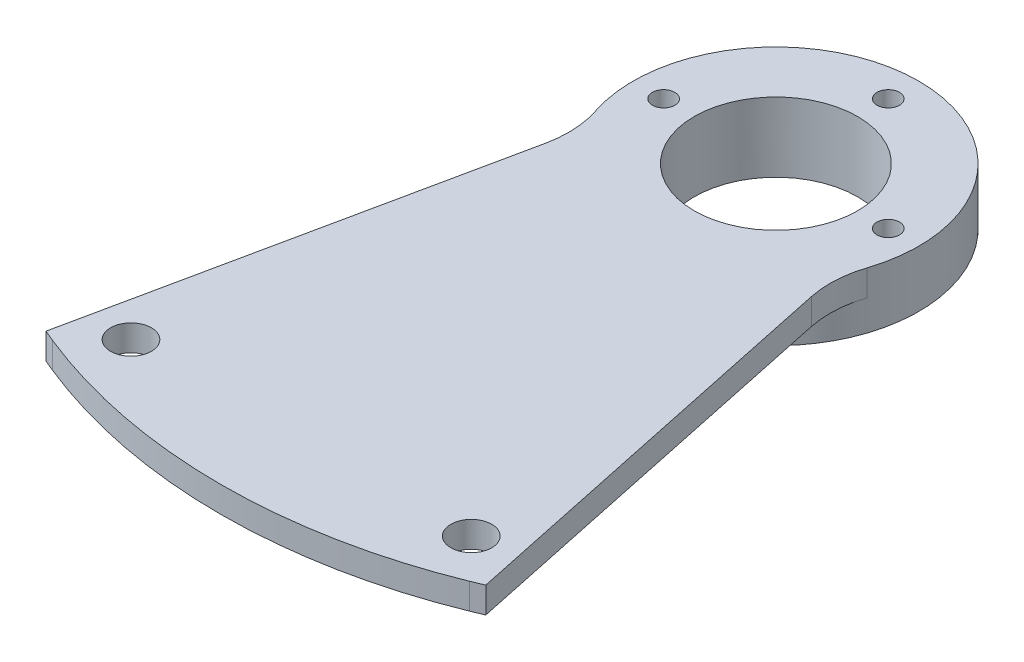
ISO-10303-21;
HEADER;
FILE_DESCRIPTION(('STEP AP214'),'2;1');
FILE_NAME('part.step','',(''),(''),'','','');
FILE_SCHEMA(('AUTOMOTIVE_DESIGN { 1 0 10303 214 1 1 1 1 }'));
ENDSEC;
DATA;
#1=APPLICATION_CONTEXT('core data for automotive mechanical design processes');
#2=APPLICATION_PROTOCOL_DEFINITION('international standard','automotive_design',2000,#1);
#3=PRODUCT_CONTEXT('',#1,'mechanical');
#4=PRODUCT('Part','Part','',(#3));
#5=PRODUCT_RELATED_PRODUCT_CATEGORY('part','',(#4));
#6=PRODUCT_DEFINITION_FORMATION('','',#4);
#7=PRODUCT_DEFINITION_CONTEXT('part definition',#1,'design');
#8=PRODUCT_DEFINITION('design','',#6,#7);
#9=PRODUCT_DEFINITION_SHAPE('','',#8);
#10=(LENGTH_UNIT() NAMED_UNIT(*) SI_UNIT(.MILLI.,.METRE.));
#11=(NAMED_UNIT(*) PLANE_ANGLE_UNIT() SI_UNIT($,.RADIAN.));
#12=(NAMED_UNIT(*) SI_UNIT($,.STERADIAN.) SOLID_ANGLE_UNIT());
#13=UNCERTAINTY_MEASURE_WITH_UNIT(LENGTH_MEASURE(1.E-05),#10,'distance_accuracy_value','');
#14=(GEOMETRIC_REPRESENTATION_CONTEXT(3) GLOBAL_UNCERTAINTY_ASSIGNED_CONTEXT((#13)) GLOBAL_UNIT_ASSIGNED_CONTEXT((#10,
#11,#12)) REPRESENTATION_CONTEXT('',''));
#15=CARTESIAN_POINT('',(0.,0.,0.));
#16=DIRECTION('',(0.,0.,1.));
#17=DIRECTION('',(1.,0.,0.));
#18=AXIS2_PLACEMENT_3D('',#15,#16,#17);
#19=CARTESIAN_POINT('',(0.,-2.999994,0.));
#20=DIRECTION('',(0.,1.,0.));
#21=DIRECTION('',(0.,0.,1.));
#22=AXIS2_PLACEMENT_3D('',#19,#20,#21);
#23=PLANE('',#22);
#24=CARTESIAN_POINT('',(0.,-2.999994,9.72130000166609));
#25=DIRECTION('',(0.,1.,0.));
#26=DIRECTION('',(0.,0.,1.));
#27=AXIS2_PLACEMENT_3D('',#24,#25,#26);
#28=CIRCLE('',#27,14.);
#29=CARTESIAN_POINT('',(0.,-2.999994,23.7213000016661));
#30=VERTEX_POINT('',#29);
#31=EDGE_CURVE('E317',#30,#30,#28,.T.);
#32=ORIENTED_EDGE('',*,*,#31,.F.);
#33=EDGE_LOOP('',(#32));
#34=FACE_BOUND('',#33,.T.);
#35=CARTESIAN_POINT('',(0.,-2.999994,-1.27869999833391));
#36=DIRECTION('',(0.,1.,0.));
#37=DIRECTION('',(0.,0.,1.));
#38=AXIS2_PLACEMENT_3D('',#35,#36,#37);
#39=CIRCLE('',#38,1.1);
#40=CARTESIAN_POINT('',(0.,-2.999994,-0.178699998333911));
#41=VERTEX_POINT('',#40);
#42=EDGE_CURVE('E314',#41,#41,#39,.T.);
#43=ORIENTED_EDGE('',*,*,#42,.T.);
#44=EDGE_LOOP('',(#43));
#45=FACE_BOUND('',#44,.T.);
#46=CARTESIAN_POINT('',(11.,-2.999994,9.72130000166609));
#47=DIRECTION('',(0.,1.,0.));
#48=DIRECTION('',(0.,0.,1.));
#49=AXIS2_PLACEMENT_3D('',#46,#47,#48);
#50=CIRCLE('',#49,1.1);
#51=CARTESIAN_POINT('',(11.,-2.999994,10.8213000016661));
#52=VERTEX_POINT('',#51);
#53=EDGE_CURVE('E307',#52,#52,#50,.T.);
#54=ORIENTED_EDGE('',*,*,#53,.T.);
#55=EDGE_LOOP('',(#54));
#56=FACE_BOUND('',#55,.T.);
#57=CARTESIAN_POINT('',(-11.,-2.999994,9.7213000016661));
#58=DIRECTION('',(0.,1.,0.));
#59=DIRECTION('',(0.,0.,1.));
#60=AXIS2_PLACEMENT_3D('',#57,#58,#59);
#61=CIRCLE('',#60,1.09999999999999);
#62=CARTESIAN_POINT('',(-11.,-2.999994,10.8213000016661));
#63=VERTEX_POINT('',#62);
#64=EDGE_CURVE('E303',#63,#63,#61,.T.);
#65=ORIENTED_EDGE('',*,*,#64,.T.);
#66=EDGE_LOOP('',(#65));
#67=FACE_BOUND('',#66,.T.);
#68=CARTESIAN_POINT('',(0.,-2.999994,9.72130000166609));
#69=DIRECTION('',(0.,1.,0.));
#70=DIRECTION('',(0.,0.,1.));
#71=AXIS2_PLACEMENT_3D('',#68,#69,#70);
#72=CIRCLE('',#71,9.);
#73=CARTESIAN_POINT('',(0.,-2.999994,18.7213000016661));
#74=VERTEX_POINT('',#73);
#75=EDGE_CURVE('E11',#74,#74,#72,.F.);
#76=ORIENTED_EDGE('',*,*,#75,.F.);
#77=EDGE_LOOP('',(#76));
#78=FACE_BOUND('',#77,.T.);
#79=ADVANCED_FACE('F34',(#34,#45,#56,#67,#78),#23,.F.);
#80=CARTESIAN_POINT('',(8.56841564748164,2.54,-1.80723900880772));
#81=DIRECTION('',(0.978472319325836,0.,-0.20637810037191));
#82=DIRECTION('',(-0.20637810037191,0.,-0.978472319325837));
#83=AXIS2_PLACEMENT_3D('',#80,#81,#82);
#84=PLANE('',#83);
#85=DIRECTION('',(0.20637810037191,0.,0.978472319325837));
#86=VECTOR('',#85,1.);
#87=CARTESIAN_POINT('',(8.56841564748164,0.,-1.80723900880772));
#88=LINE('',#87,#86);
#89=CARTESIAN_POINT('',(13.0156650120618,0.,19.2778974108964));
#90=VERTEX_POINT('',#89);
#91=CARTESIAN_POINT('',(21.5361568841167,0.,59.6749425858563));
#92=VERTEX_POINT('',#91);
#93=EDGE_CURVE('E319',#90,#92,#88,.T.);
#94=ORIENTED_EDGE('',*,*,#93,.F.);
#95=DIRECTION('',(0.,-1.,0.));
#96=VECTOR('',#95,1.);
#97=CARTESIAN_POINT('',(13.0156650120618,2.54,19.2778974108964));
#98=LINE('',#97,#96);
#99=CARTESIAN_POINT('',(13.0156650120618,2.54,19.2778974108964));
#100=VERTEX_POINT('',#99);
#101=EDGE_CURVE('E49',#90,#100,#98,.F.);
#102=ORIENTED_EDGE('',*,*,#101,.T.);
#103=DIRECTION('',(0.20637810037191,0.,0.978472319325837));
#104=VECTOR('',#103,1.);
#105=CARTESIAN_POINT('',(8.56841564748164,2.54,-1.80723900880772));
#106=LINE('',#105,#104);
#107=CARTESIAN_POINT('',(21.5361568841167,2.54,59.6749425858563));
#108=VERTEX_POINT('',#107);
#109=EDGE_CURVE('E136',#100,#108,#106,.T.);
#110=ORIENTED_EDGE('',*,*,#109,.T.);
#111=DIRECTION('',(0.,-1.,0.));
#112=VECTOR('',#111,1.);
#113=CARTESIAN_POINT('',(21.5361568841167,2.54,59.6749425858563));
#114=LINE('',#113,#112);
#115=EDGE_CURVE('E351',#108,#92,#114,.T.);
#116=ORIENTED_EDGE('',*,*,#115,.T.);
#117=EDGE_LOOP('',(#94,#102,#110,#116));
#118=FACE_BOUND('',#117,.T.);
#119=ADVANCED_FACE('F150',(#118),#84,.T.);
#120=CARTESIAN_POINT('',(0.,2.54,9.72130000166609));
#121=DIRECTION('',(0.,-1.,0.));
#122=DIRECTION('',(0.,0.,-1.));
#123=AXIS2_PLACEMENT_3D('',#120,#121,#122);
#124=CYLINDRICAL_SURFACE('',#123,14.);
#125=DIRECTION('',(0.,-1.,0.));
#126=VECTOR('',#125,1.);
#127=CARTESIAN_POINT('',(13.3002264531034,2.54,14.0921095715476));
#128=LINE('',#127,#126);
#129=CARTESIAN_POINT('',(13.3002264531034,2.54,14.0921095715476));
#130=VERTEX_POINT('',#129);
#131=CARTESIAN_POINT('',(13.3002264531034,0.,14.0921095715476));
#132=VERTEX_POINT('',#131);
#133=EDGE_CURVE('E106',#130,#132,#128,.T.);
#134=ORIENTED_EDGE('',*,*,#133,.T.);
#135=CARTESIAN_POINT('',(0.,0.,9.72130000166609));
#136=DIRECTION('',(0.,1.,0.));
#137=DIRECTION('',(0.,0.,1.));
#138=AXIS2_PLACEMENT_3D('',#135,#136,#137);
#139=CIRCLE('',#138,14.);
#140=CARTESIAN_POINT('',(-13.3002264531034,0.,14.0921095715476));
#141=VERTEX_POINT('',#140);
#142=EDGE_CURVE('E42',#141,#132,#139,.T.);
#143=ORIENTED_EDGE('',*,*,#142,.F.);
#144=DIRECTION('',(0.,-1.,0.));
#145=VECTOR('',#144,1.);
#146=CARTESIAN_POINT('',(-13.3002264531034,2.54,14.0921095715476));
#147=LINE('',#146,#145);
#148=CARTESIAN_POINT('',(-13.3002264531034,2.54,14.0921095715476));
#149=VERTEX_POINT('',#148);
#150=EDGE_CURVE('E103',#141,#149,#147,.F.);
#151=ORIENTED_EDGE('',*,*,#150,.T.);
#152=CARTESIAN_POINT('',(0.,2.54,9.72130000166609));
#153=DIRECTION('',(0.,1.,0.));
#154=DIRECTION('',(0.,0.,1.));
#155=AXIS2_PLACEMENT_3D('',#152,#153,#154);
#156=CIRCLE('',#155,14.);
#157=EDGE_CURVE('E134',#130,#149,#156,.T.);
#158=ORIENTED_EDGE('',*,*,#157,.F.);
#159=EDGE_LOOP('',(#134,#143,#151,#158));
#160=FACE_BOUND('',#159,.T.);
#161=ORIENTED_EDGE('',*,*,#31,.T.);
#162=EDGE_LOOP('',(#161));
#163=FACE_BOUND('',#162,.T.);
#164=ADVANCED_FACE('F99',(#160,#163),#124,.T.);
#165=CARTESIAN_POINT('',(-8.56841564748165,2.54,-1.80723900880772));
#166=DIRECTION('',(-0.978472319325837,0.,-0.20637810037191));
#167=DIRECTION('',(-0.20637810037191,0.,0.978472319325837));
#168=AXIS2_PLACEMENT_3D('',#165,#166,#167);
#169=PLANE('',#168);
#170=DIRECTION('',(0.20637810037191,0.,-0.978472319325837));
#171=VECTOR('',#170,1.);
#172=CARTESIAN_POINT('',(-8.56841564748165,2.54,-1.80723900880772));
#173=LINE('',#172,#171);
#174=CARTESIAN_POINT('',(-21.5361568841167,2.54,59.6749425858563));
#175=VERTEX_POINT('',#174);
#176=CARTESIAN_POINT('',(-13.0156650120618,2.54,19.2778974108963));
#177=VERTEX_POINT('',#176);
#178=EDGE_CURVE('E138',#175,#177,#173,.T.);
#179=ORIENTED_EDGE('',*,*,#178,.T.);
#180=DIRECTION('',(0.,-1.,0.));
#181=VECTOR('',#180,1.);
#182=CARTESIAN_POINT('',(-13.0156650120618,2.54,19.2778974108963));
#183=LINE('',#182,#181);
#184=CARTESIAN_POINT('',(-13.0156650120618,0.,19.2778974108963));
#185=VERTEX_POINT('',#184);
#186=EDGE_CURVE('E125',#177,#185,#183,.T.);
#187=ORIENTED_EDGE('',*,*,#186,.T.);
#188=DIRECTION('',(0.20637810037191,0.,-0.978472319325837));
#189=VECTOR('',#188,1.);
#190=CARTESIAN_POINT('',(-8.56841564748165,0.,-1.80723900880772));
#191=LINE('',#190,#189);
#192=CARTESIAN_POINT('',(-21.5361568841167,0.,59.6749425858563));
#193=VERTEX_POINT('',#192);
#194=EDGE_CURVE('E115',#193,#185,#191,.T.);
#195=ORIENTED_EDGE('',*,*,#194,.F.);
#196=DIRECTION('',(0.,-1.,0.));
#197=VECTOR('',#196,1.);
#198=CARTESIAN_POINT('',(-21.5361568841167,2.54,59.6749425858563));
#199=LINE('',#198,#197);
#200=EDGE_CURVE('E374',#175,#193,#199,.T.);
#201=ORIENTED_EDGE('',*,*,#200,.F.);
#202=EDGE_LOOP('',(#179,#187,#195,#201));
#203=FACE_BOUND('',#202,.T.);
#204=ADVANCED_FACE('F200',(#203),#169,.T.);
#205=CARTESIAN_POINT('',(-24.43214967919,2.54,58.4647199158263));
#206=DIRECTION('',(0.38558134753756,0.,-0.922673845099729));
#207=DIRECTION('',(-0.922673845099729,0.,-0.38558134753756));
#208=AXIS2_PLACEMENT_3D('',#205,#206,#207);
#209=PLANE('',#208);
#210=DIRECTION('',(0.922673845099729,0.,0.38558134753756));
#211=VECTOR('',#210,1.);
#212=CARTESIAN_POINT('',(-24.43214967919,0.,58.4647199158263));
#213=LINE('',#212,#211);
#214=CARTESIAN_POINT('',(-20.4111298530471,0.,60.1450864410873));
#215=VERTEX_POINT('',#214);
#216=EDGE_CURVE('E354',#193,#215,#213,.T.);
#217=ORIENTED_EDGE('',*,*,#216,.T.);
#218=DIRECTION('',(0.,-1.,0.));
#219=VECTOR('',#218,1.);
#220=CARTESIAN_POINT('',(-20.4111298530471,2.54,60.1450864410873));
#221=LINE('',#220,#219);
#222=CARTESIAN_POINT('',(-20.4111298530471,2.54,60.1450864410873));
#223=VERTEX_POINT('',#222);
#224=EDGE_CURVE('E372',#223,#215,#221,.T.);
#225=ORIENTED_EDGE('',*,*,#224,.F.);
#226=DIRECTION('',(0.922673845099729,0.,0.38558134753756));
#227=VECTOR('',#226,1.);
#228=CARTESIAN_POINT('',(-24.43214967919,2.54,58.4647199158263));
#229=LINE('',#228,#227);
#230=EDGE_CURVE('E325',#175,#223,#229,.T.);
#231=ORIENTED_EDGE('',*,*,#230,.F.);
#232=ORIENTED_EDGE('',*,*,#200,.T.);
#233=EDGE_LOOP('',(#217,#225,#231,#232));
#234=FACE_BOUND('',#233,.T.);
#235=ADVANCED_FACE('F196',(#234),#209,.F.);
#236=CARTESIAN_POINT('',(0.,2.54,9.72130000166609));
#237=DIRECTION('',(0.,-1.,0.));
#238=DIRECTION('',(0.,0.,-1.));
#239=AXIS2_PLACEMENT_3D('',#236,#237,#238);
#240=CYLINDRICAL_SURFACE('',#239,54.3982762664986);
#241=CARTESIAN_POINT('',(0.,0.,9.72130000166609));
#242=DIRECTION('',(0.,1.,0.));
#243=DIRECTION('',(0.,0.,1.));
#244=AXIS2_PLACEMENT_3D('',#241,#242,#243);
#245=CIRCLE('',#244,54.3982762664986);
#246=CARTESIAN_POINT('',(20.4111298530471,0.,60.1450864410873));
#247=VERTEX_POINT('',#246);
#248=EDGE_CURVE('E357',#247,#215,#245,.F.);
#249=ORIENTED_EDGE('',*,*,#248,.F.);
#250=DIRECTION('',(0.,-1.,0.));
#251=VECTOR('',#250,1.);
#252=CARTESIAN_POINT('',(20.4111298530471,2.54,60.1450864410873));
#253=LINE('',#252,#251);
#254=CARTESIAN_POINT('',(20.4111298530471,2.54,60.1450864410873));
#255=VERTEX_POINT('',#254);
#256=EDGE_CURVE('E370',#255,#247,#253,.T.);
#257=ORIENTED_EDGE('',*,*,#256,.F.);
#258=CARTESIAN_POINT('',(0.,2.54,9.72130000166609));
#259=DIRECTION('',(0.,1.,0.));
#260=DIRECTION('',(0.,0.,1.));
#261=AXIS2_PLACEMENT_3D('',#258,#259,#260);
#262=CIRCLE('',#261,54.3982762664986);
#263=EDGE_CURVE('E327',#255,#223,#262,.F.);
#264=ORIENTED_EDGE('',*,*,#263,.T.);
#265=ORIENTED_EDGE('',*,*,#224,.T.);
#266=EDGE_LOOP('',(#249,#257,#264,#265));
#267=FACE_BOUND('',#266,.T.);
#268=ADVANCED_FACE('F174',(#267),#240,.T.);
#269=CARTESIAN_POINT('',(-16.6659753937199,2.54,56.2232888843658));
#270=DIRECTION('',(0.,-1.,0.));
#271=DIRECTION('',(0.,0.,-1.));
#272=AXIS2_PLACEMENT_3D('',#269,#270,#271);
#273=CYLINDRICAL_SURFACE('',#272,1.99999994336487);
#274=CARTESIAN_POINT('',(-16.6659753937199,2.54,56.2232888843658));
#275=DIRECTION('',(0.,1.,0.));
#276=DIRECTION('',(0.,0.,1.));
#277=AXIS2_PLACEMENT_3D('',#274,#275,#276);
#278=CIRCLE('',#277,1.99999994336487);
#279=CARTESIAN_POINT('',(-16.6659753937199,2.54,58.2232888277306));
#280=VERTEX_POINT('',#279);
#281=EDGE_CURVE('E345',#280,#280,#278,.T.);
#282=ORIENTED_EDGE('',*,*,#281,.T.);
#283=EDGE_LOOP('',(#282));
#284=FACE_BOUND('',#283,.T.);
#285=CARTESIAN_POINT('',(-16.6659753937199,0.,56.2232888843658));
#286=DIRECTION('',(0.,1.,0.));
#287=DIRECTION('',(0.,0.,1.));
#288=AXIS2_PLACEMENT_3D('',#285,#286,#287);
#289=CIRCLE('',#288,1.99999994336487);
#290=CARTESIAN_POINT('',(-16.6659753937199,0.,58.2232888277306));
#291=VERTEX_POINT('',#290);
#292=EDGE_CURVE('E363',#291,#291,#289,.T.);
#293=ORIENTED_EDGE('',*,*,#292,.F.);
#294=EDGE_LOOP('',(#293));
#295=FACE_BOUND('',#294,.T.);
#296=ADVANCED_FACE('F170',(#284,#295),#273,.F.);
#297=CARTESIAN_POINT('',(0.,2.54,9.72130000166609));
#298=DIRECTION('',(0.,-1.,0.));
#299=DIRECTION('',(0.,0.,-1.));
#300=AXIS2_PLACEMENT_3D('',#297,#298,#299);
#301=CYLINDRICAL_SURFACE('',#300,8.00000000000001);
#302=CARTESIAN_POINT('',(0.,2.54,9.72130000166609));
#303=DIRECTION('',(0.,1.,0.));
#304=DIRECTION('',(0.,0.,1.));
#305=AXIS2_PLACEMENT_3D('',#302,#303,#304);
#306=CIRCLE('',#305,8.00000000000001);
#307=CARTESIAN_POINT('',(0.,2.54,17.7213000016661));
#308=VERTEX_POINT('',#307);
#309=EDGE_CURVE('E342',#308,#308,#306,.F.);
#310=ORIENTED_EDGE('',*,*,#309,.F.);
#311=EDGE_LOOP('',(#310));
#312=FACE_BOUND('',#311,.T.);
#313=CARTESIAN_POINT('',(0.,-4.269994,9.72130000166609));
#314=DIRECTION('',(0.,-1.,0.));
#315=DIRECTION('',(0.,0.,-1.));
#316=AXIS2_PLACEMENT_3D('',#313,#314,#315);
#317=CIRCLE('',#316,8.00000000000001);
#318=CARTESIAN_POINT('',(0.,-4.269994,1.72130000166609));
#319=VERTEX_POINT('',#318);
#320=EDGE_CURVE('E304',#319,#319,#317,.T.);
#321=ORIENTED_EDGE('',*,*,#320,.T.);
#322=EDGE_LOOP('',(#321));
#323=FACE_BOUND('',#322,.T.);
#324=ADVANCED_FACE('F173',(#312,#323),#301,.F.);
#325=CARTESIAN_POINT('',(0.,2.54,-1.27869999833391));
#326=DIRECTION('',(0.,-1.,0.));
#327=DIRECTION('',(0.,0.,-1.));
#328=AXIS2_PLACEMENT_3D('',#325,#326,#327);
#329=CYLINDRICAL_SURFACE('',#328,1.1);
#330=CARTESIAN_POINT('',(0.,2.54,-1.27869999833391));
#331=DIRECTION('',(0.,1.,0.));
#332=DIRECTION('',(0.,0.,1.));
#333=AXIS2_PLACEMENT_3D('',#330,#331,#332);
#334=CIRCLE('',#333,1.1);
#335=CARTESIAN_POINT('',(0.,2.54,-0.178699998333911));
#336=VERTEX_POINT('',#335);
#337=EDGE_CURVE('E339',#336,#336,#334,.T.);
#338=ORIENTED_EDGE('',*,*,#337,.T.);
#339=EDGE_LOOP('',(#338));
#340=FACE_BOUND('',#339,.T.);
#341=ORIENTED_EDGE('',*,*,#42,.F.);
#342=EDGE_LOOP('',(#341));
#343=FACE_BOUND('',#342,.T.);
#344=ADVANCED_FACE('F178',(#340,#343),#329,.F.);
#345=CARTESIAN_POINT('',(11.,2.54,9.72130000166609));
#346=DIRECTION('',(0.,-1.,0.));
#347=DIRECTION('',(0.,0.,-1.));
#348=AXIS2_PLACEMENT_3D('',#345,#346,#347);
#349=CYLINDRICAL_SURFACE('',#348,1.1);
#350=CARTESIAN_POINT('',(11.,2.54,9.72130000166609));
#351=DIRECTION('',(0.,1.,0.));
#352=DIRECTION('',(0.,0.,1.));
#353=AXIS2_PLACEMENT_3D('',#350,#351,#352);
#354=CIRCLE('',#353,1.1);
#355=CARTESIAN_POINT('',(11.,2.54,10.8213000016661));
#356=VERTEX_POINT('',#355);
#357=EDGE_CURVE('E336',#356,#356,#354,.T.);
#358=ORIENTED_EDGE('',*,*,#357,.T.);
#359=EDGE_LOOP('',(#358));
#360=FACE_BOUND('',#359,.T.);
#361=ORIENTED_EDGE('',*,*,#53,.F.);
#362=EDGE_LOOP('',(#361));
#363=FACE_BOUND('',#362,.T.);
#364=ADVANCED_FACE('F182',(#360,#363),#349,.F.);
#365=CARTESIAN_POINT('',(-11.,2.54,9.7213000016661));
#366=DIRECTION('',(0.,-1.,0.));
#367=DIRECTION('',(0.,0.,-1.));
#368=AXIS2_PLACEMENT_3D('',#365,#366,#367);
#369=CYLINDRICAL_SURFACE('',#368,1.09999999999999);
#370=CARTESIAN_POINT('',(-11.,2.54,9.7213000016661));
#371=DIRECTION('',(0.,1.,0.));
#372=DIRECTION('',(0.,0.,1.));
#373=AXIS2_PLACEMENT_3D('',#370,#371,#372);
#374=CIRCLE('',#373,1.09999999999999);
#375=CARTESIAN_POINT('',(-11.,2.54,10.8213000016661));
#376=VERTEX_POINT('',#375);
#377=EDGE_CURVE('E333',#376,#376,#374,.T.);
#378=ORIENTED_EDGE('',*,*,#377,.T.);
#379=EDGE_LOOP('',(#378));
#380=FACE_BOUND('',#379,.T.);
#381=ORIENTED_EDGE('',*,*,#64,.F.);
#382=EDGE_LOOP('',(#381));
#383=FACE_BOUND('',#382,.T.);
#384=ADVANCED_FACE('F186',(#380,#383),#369,.F.);
#385=CARTESIAN_POINT('',(24.4321496791903,2.54,58.4647199158262));
#386=DIRECTION('',(0.385581347537565,0.,0.922673845099727));
#387=DIRECTION('',(0.922673845099727,0.,-0.385581347537565));
#388=AXIS2_PLACEMENT_3D('',#385,#386,#387);
#389=PLANE('',#388);
#390=DIRECTION('',(-0.922673845099727,0.,0.385581347537565));
#391=VECTOR('',#390,1.);
#392=CARTESIAN_POINT('',(24.4321496791903,0.,58.4647199158262));
#393=LINE('',#392,#391);
#394=EDGE_CURVE('E360',#92,#247,#393,.T.);
#395=ORIENTED_EDGE('',*,*,#394,.F.);
#396=ORIENTED_EDGE('',*,*,#115,.F.);
#397=DIRECTION('',(-0.922673845099727,0.,0.385581347537565));
#398=VECTOR('',#397,1.);
#399=CARTESIAN_POINT('',(24.4321496791903,2.54,58.4647199158262));
#400=LINE('',#399,#398);
#401=EDGE_CURVE('E330',#108,#255,#400,.T.);
#402=ORIENTED_EDGE('',*,*,#401,.T.);
#403=ORIENTED_EDGE('',*,*,#256,.T.);
#404=EDGE_LOOP('',(#395,#396,#402,#403));
#405=FACE_BOUND('',#404,.T.);
#406=ADVANCED_FACE('F168',(#405),#389,.T.);
#407=CARTESIAN_POINT('',(16.6659753937201,2.54,56.2232888843657));
#408=DIRECTION('',(0.,-1.,0.));
#409=DIRECTION('',(0.,0.,-1.));
#410=AXIS2_PLACEMENT_3D('',#407,#408,#409);
#411=CYLINDRICAL_SURFACE('',#410,1.99999994336488);
#412=CARTESIAN_POINT('',(16.6659753937201,2.54,56.2232888843657));
#413=DIRECTION('',(0.,1.,0.));
#414=DIRECTION('',(0.,0.,1.));
#415=AXIS2_PLACEMENT_3D('',#412,#413,#414);
#416=CIRCLE('',#415,1.99999994336488);
#417=CARTESIAN_POINT('',(16.6659753937201,2.54,58.2232888277306));
#418=VERTEX_POINT('',#417);
#419=EDGE_CURVE('E348',#418,#418,#416,.T.);
#420=ORIENTED_EDGE('',*,*,#419,.T.);
#421=EDGE_LOOP('',(#420));
#422=FACE_BOUND('',#421,.T.);
#423=CARTESIAN_POINT('',(16.6659753937201,0.,56.2232888843657));
#424=DIRECTION('',(0.,1.,0.));
#425=DIRECTION('',(0.,0.,1.));
#426=AXIS2_PLACEMENT_3D('',#423,#424,#425);
#427=CIRCLE('',#426,1.99999994336488);
#428=CARTESIAN_POINT('',(16.6659753937201,0.,58.2232888277306));
#429=VERTEX_POINT('',#428);
#430=EDGE_CURVE('E321',#429,#429,#427,.T.);
#431=ORIENTED_EDGE('',*,*,#430,.F.);
#432=EDGE_LOOP('',(#431));
#433=FACE_BOUND('',#432,.T.);
#434=ADVANCED_FACE('F163',(#422,#433),#411,.F.);
#435=CARTESIAN_POINT('',(0.,2.54,0.));
#436=DIRECTION('',(0.,1.,0.));
#437=DIRECTION('',(0.,0.,1.));
#438=AXIS2_PLACEMENT_3D('',#435,#436,#437);
#439=PLANE('',#438);
#440=ORIENTED_EDGE('',*,*,#109,.F.);
#441=CARTESIAN_POINT('',(22.8003882053202,2.54,17.2141164071773));
#442=DIRECTION('',(0.,1.,0.));
#443=DIRECTION('',(0.,0.,1.));
#444=AXIS2_PLACEMENT_3D('',#441,#442,#443);
#445=CIRCLE('',#444,10.);
#446=EDGE_CURVE('E107',#100,#130,#445,.F.);
#447=ORIENTED_EDGE('',*,*,#446,.T.);
#448=ORIENTED_EDGE('',*,*,#157,.T.);
#449=CARTESIAN_POINT('',(-22.8003882053202,2.54,17.2141164071772));
#450=DIRECTION('',(0.,1.,0.));
#451=DIRECTION('',(0.,0.,1.));
#452=AXIS2_PLACEMENT_3D('',#449,#450,#451);
#453=CIRCLE('',#452,10.);
#454=EDGE_CURVE('E119',#149,#177,#453,.F.);
#455=ORIENTED_EDGE('',*,*,#454,.T.);
#456=ORIENTED_EDGE('',*,*,#178,.F.);
#457=ORIENTED_EDGE('',*,*,#230,.T.);
#458=ORIENTED_EDGE('',*,*,#263,.F.);
#459=ORIENTED_EDGE('',*,*,#401,.F.);
#460=EDGE_LOOP('',(#440,#447,#448,#455,#456,#457,#458,#459));
#461=FACE_BOUND('',#460,.T.);
#462=ORIENTED_EDGE('',*,*,#377,.F.);
#463=EDGE_LOOP('',(#462));
#464=FACE_BOUND('',#463,.T.);
#465=ORIENTED_EDGE('',*,*,#357,.F.);
#466=EDGE_LOOP('',(#465));
#467=FACE_BOUND('',#466,.T.);
#468=ORIENTED_EDGE('',*,*,#337,.F.);
#469=EDGE_LOOP('',(#468));
#470=FACE_BOUND('',#469,.T.);
#471=ORIENTED_EDGE('',*,*,#309,.T.);
#472=EDGE_LOOP('',(#471));
#473=FACE_BOUND('',#472,.T.);
#474=ORIENTED_EDGE('',*,*,#281,.F.);
#475=EDGE_LOOP('',(#474));
#476=FACE_BOUND('',#475,.T.);
#477=ORIENTED_EDGE('',*,*,#419,.F.);
#478=EDGE_LOOP('',(#477));
#479=FACE_BOUND('',#478,.T.);
#480=ADVANCED_FACE('F132',(#461,#464,#467,#470,#473,#476,#479),#439,.T.);
#481=CARTESIAN_POINT('',(0.,0.,0.));
#482=DIRECTION('',(0.,1.,0.));
#483=DIRECTION('',(0.,0.,1.));
#484=AXIS2_PLACEMENT_3D('',#481,#482,#483);
#485=PLANE('',#484);
#486=CARTESIAN_POINT('',(-22.8003882053202,0.,17.2141164071772));
#487=DIRECTION('',(0.,1.,0.));
#488=DIRECTION('',(0.,0.,1.));
#489=AXIS2_PLACEMENT_3D('',#486,#487,#488);
#490=CIRCLE('',#489,10.);
#491=EDGE_CURVE('E110',#185,#141,#490,.T.);
#492=ORIENTED_EDGE('',*,*,#491,.T.);
#493=ORIENTED_EDGE('',*,*,#142,.T.);
#494=CARTESIAN_POINT('',(22.8003882053202,0.,17.2141164071773));
#495=DIRECTION('',(0.,1.,0.));
#496=DIRECTION('',(0.,0.,1.));
#497=AXIS2_PLACEMENT_3D('',#494,#495,#496);
#498=CIRCLE('',#497,10.);
#499=EDGE_CURVE('E57',#132,#90,#498,.T.);
#500=ORIENTED_EDGE('',*,*,#499,.T.);
#501=ORIENTED_EDGE('',*,*,#93,.T.);
#502=ORIENTED_EDGE('',*,*,#394,.T.);
#503=ORIENTED_EDGE('',*,*,#248,.T.);
#504=ORIENTED_EDGE('',*,*,#216,.F.);
#505=ORIENTED_EDGE('',*,*,#194,.T.);
#506=EDGE_LOOP('',(#492,#493,#500,#501,#502,#503,#504,#505));
#507=FACE_BOUND('',#506,.T.);
#508=ORIENTED_EDGE('',*,*,#292,.T.);
#509=EDGE_LOOP('',(#508));
#510=FACE_BOUND('',#509,.T.);
#511=ORIENTED_EDGE('',*,*,#430,.T.);
#512=EDGE_LOOP('',(#511));
#513=FACE_BOUND('',#512,.T.);
#514=ADVANCED_FACE('F111',(#507,#510,#513),#485,.F.);
#515=CARTESIAN_POINT('',(-22.8003882053202,2.54,17.2141164071772));
#516=DIRECTION('',(0.,-1.,0.));
#517=DIRECTION('',(0.,0.,-1.));
#518=AXIS2_PLACEMENT_3D('',#515,#516,#517);
#519=CYLINDRICAL_SURFACE('',#518,10.);
#520=ORIENTED_EDGE('',*,*,#454,.F.);
#521=ORIENTED_EDGE('',*,*,#150,.F.);
#522=ORIENTED_EDGE('',*,*,#491,.F.);
#523=ORIENTED_EDGE('',*,*,#186,.F.);
#524=EDGE_LOOP('',(#520,#521,#522,#523));
#525=FACE_BOUND('',#524,.T.);
#526=ADVANCED_FACE('F122',(#525),#519,.F.);
#527=CARTESIAN_POINT('',(22.8003882053202,2.54,17.2141164071773));
#528=DIRECTION('',(0.,-1.,0.));
#529=DIRECTION('',(0.,0.,-1.));
#530=AXIS2_PLACEMENT_3D('',#527,#528,#529);
#531=CYLINDRICAL_SURFACE('',#530,10.);
#532=ORIENTED_EDGE('',*,*,#446,.F.);
#533=ORIENTED_EDGE('',*,*,#101,.F.);
#534=ORIENTED_EDGE('',*,*,#499,.F.);
#535=ORIENTED_EDGE('',*,*,#133,.F.);
#536=EDGE_LOOP('',(#532,#533,#534,#535));
#537=FACE_BOUND('',#536,.T.);
#538=ADVANCED_FACE('F36',(#537),#531,.F.);
#539=CARTESIAN_POINT('',(0.,-4.269994,9.72130000166609));
#540=DIRECTION('',(0.,-1.,0.));
#541=DIRECTION('',(0.,0.,-1.));
#542=AXIS2_PLACEMENT_3D('',#539,#540,#541);
#543=PLANE('',#542);
#544=CARTESIAN_POINT('',(0.,-4.269994,9.72130000166609));
#545=DIRECTION('',(0.,-1.,0.));
#546=DIRECTION('',(0.,0.,-1.));
#547=AXIS2_PLACEMENT_3D('',#544,#545,#546);
#548=CIRCLE('',#547,9.);
#549=CARTESIAN_POINT('',(0.,-4.269994,0.721300001666094));
#550=VERTEX_POINT('',#549);
#551=EDGE_CURVE('E300',#550,#550,#548,.T.);
#552=ORIENTED_EDGE('',*,*,#551,.T.);
#553=EDGE_LOOP('',(#552));
#554=FACE_BOUND('',#553,.T.);
#555=ORIENTED_EDGE('',*,*,#320,.F.);
#556=EDGE_LOOP('',(#555));
#557=FACE_BOUND('',#556,.T.);
#558=ADVANCED_FACE('F141',(#554,#557),#543,.T.);
#559=CARTESIAN_POINT('',(0.,-4.269994,9.72130000166609));
#560=DIRECTION('',(0.,1.,0.));
#561=DIRECTION('',(0.,0.,1.));
#562=AXIS2_PLACEMENT_3D('',#559,#560,#561);
#563=CYLINDRICAL_SURFACE('',#562,9.);
#564=ORIENTED_EDGE('',*,*,#551,.F.);
#565=EDGE_LOOP('',(#564));
#566=FACE_BOUND('',#565,.T.);
#567=ORIENTED_EDGE('',*,*,#75,.T.);
#568=EDGE_LOOP('',(#567));
#569=FACE_BOUND('',#568,.T.);
#570=ADVANCED_FACE('F146',(#566,#569),#563,.T.);
#571=CLOSED_SHELL('',(#79,#119,#164,#204,#235,#268,#296,#324,#344,#364,#384,#406,#434,#480,#514,
#526,#538,#558,#570));
#572=MANIFOLD_SOLID_BREP('B2',#571);
#573=ADVANCED_BREP_SHAPE_REPRESENTATION('',(#18,#572),#14);
#574=SHAPE_DEFINITION_REPRESENTATION(#9,#573);
ENDSEC;
END-ISO-10303-21;
